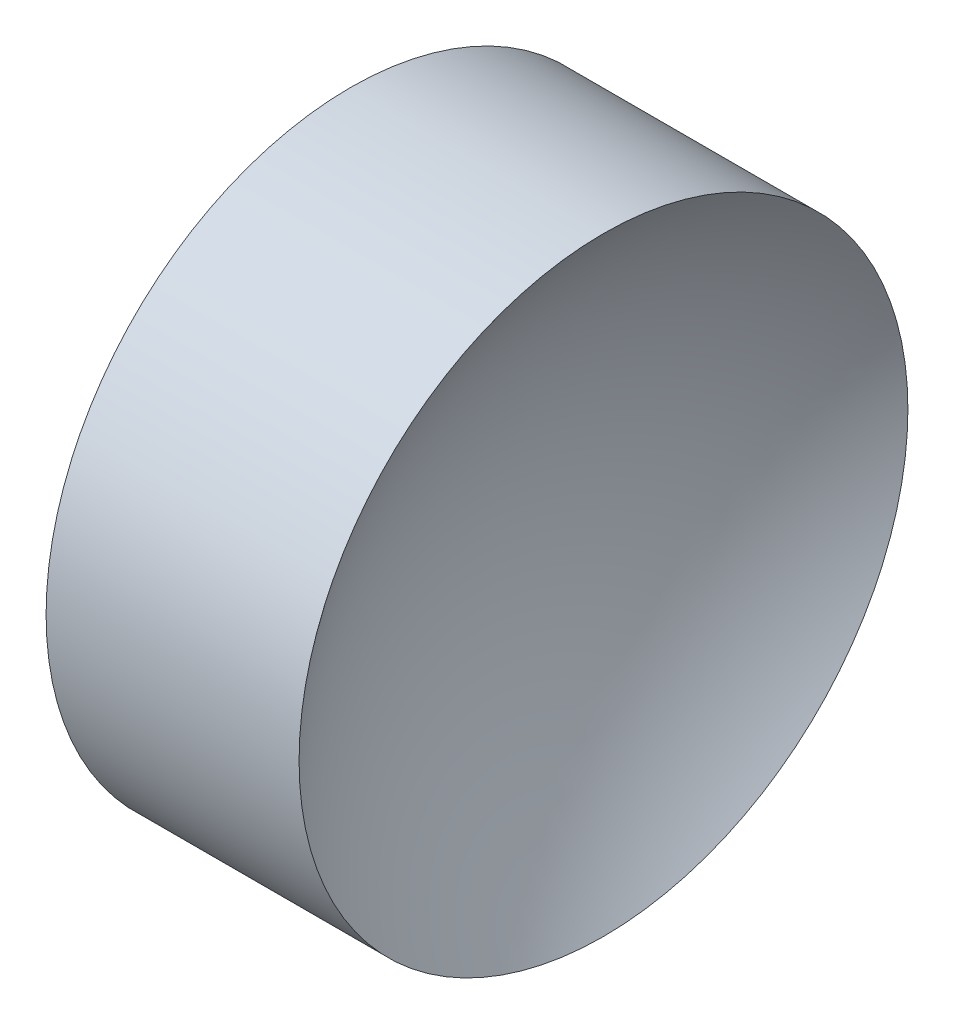
ISO-10303-21;
HEADER;
FILE_DESCRIPTION(('STEP AP214'),'2;1');
FILE_NAME('part.step','',(''),(''),'','','');
FILE_SCHEMA(('AUTOMOTIVE_DESIGN { 1 0 10303 214 1 1 1 1 }'));
ENDSEC;
DATA;
#1=APPLICATION_CONTEXT('core data for automotive mechanical design processes');
#2=APPLICATION_PROTOCOL_DEFINITION('international standard','automotive_design',2000,#1);
#3=PRODUCT_CONTEXT('',#1,'mechanical');
#4=PRODUCT('Part','Part','',(#3));
#5=PRODUCT_RELATED_PRODUCT_CATEGORY('part','',(#4));
#6=PRODUCT_DEFINITION_FORMATION('','',#4);
#7=PRODUCT_DEFINITION_CONTEXT('part definition',#1,'design');
#8=PRODUCT_DEFINITION('design','',#6,#7);
#9=PRODUCT_DEFINITION_SHAPE('','',#8);
#10=(LENGTH_UNIT() NAMED_UNIT(*) SI_UNIT(.MILLI.,.METRE.));
#11=(NAMED_UNIT(*) PLANE_ANGLE_UNIT() SI_UNIT($,.RADIAN.));
#12=(NAMED_UNIT(*) SI_UNIT($,.STERADIAN.) SOLID_ANGLE_UNIT());
#13=UNCERTAINTY_MEASURE_WITH_UNIT(LENGTH_MEASURE(1.E-05),#10,'distance_accuracy_value','');
#14=(GEOMETRIC_REPRESENTATION_CONTEXT(3) GLOBAL_UNCERTAINTY_ASSIGNED_CONTEXT((#13)) GLOBAL_UNIT_ASSIGNED_CONTEXT((#10,
#11,#12)) REPRESENTATION_CONTEXT('',''));
#15=CARTESIAN_POINT('',(0.,0.,0.));
#16=DIRECTION('',(0.,0.,1.));
#17=DIRECTION('',(1.,0.,0.));
#18=AXIS2_PLACEMENT_3D('',#15,#16,#17);
#19=CARTESIAN_POINT('',(379.562400985655,112.592117064009,0.));
#20=DIRECTION('',(-1.,0.,0.));
#21=DIRECTION('',(0.,-1.,0.));
#22=AXIS2_PLACEMENT_3D('',#19,#20,#21);
#23=SPHERICAL_SURFACE('',#22,10.);
#24=CARTESIAN_POINT('',(371.756153487657,112.592117064009,0.));
#25=DIRECTION('',(-1.,0.,0.));
#26=DIRECTION('',(0.,0.,1.));
#27=AXIS2_PLACEMENT_3D('',#24,#25,#26);
#28=CIRCLE('',#27,6.25000000000001);
#29=CARTESIAN_POINT('',(371.756153487657,112.592117064009,6.25000000000001));
#30=VERTEX_POINT('',#29);
#31=EDGE_CURVE('E10',#30,#30,#28,.T.);
#32=ORIENTED_EDGE('',*,*,#31,.F.);
#33=EDGE_LOOP('',(#32));
#34=FACE_BOUND('',#33,.T.);
#35=ADVANCED_FACE('F35',(#34),#23,.F.);
#36=CARTESIAN_POINT('',(363.508644719278,112.592117064009,0.));
#37=DIRECTION('',(-1.,0.,0.));
#38=DIRECTION('',(0.,0.,1.));
#39=AXIS2_PLACEMENT_3D('',#36,#37,#38);
#40=CYLINDRICAL_SURFACE('',#39,6.25000000000001);
#41=CARTESIAN_POINT('',(366.562400985655,112.592117064009,0.));
#42=DIRECTION('',(-1.,0.,0.));
#43=DIRECTION('',(0.,0.,1.));
#44=AXIS2_PLACEMENT_3D('',#41,#42,#43);
#45=CIRCLE('',#44,6.25000000000001);
#46=CARTESIAN_POINT('',(366.562400985655,112.592117064009,6.25000000000001));
#47=VERTEX_POINT('',#46);
#48=EDGE_CURVE('E41',#47,#47,#45,.T.);
#49=ORIENTED_EDGE('',*,*,#48,.F.);
#50=EDGE_LOOP('',(#49));
#51=FACE_BOUND('',#50,.T.);
#52=ORIENTED_EDGE('',*,*,#31,.T.);
#53=EDGE_LOOP('',(#52));
#54=FACE_BOUND('',#53,.T.);
#55=ADVANCED_FACE('F49',(#51,#54),#40,.T.);
#56=CARTESIAN_POINT('',(366.562400985655,112.592117064009,0.));
#57=DIRECTION('',(1.,0.,0.));
#58=DIRECTION('',(0.,0.,-1.));
#59=AXIS2_PLACEMENT_3D('',#56,#57,#58);
#60=PLANE('',#59);
#61=ORIENTED_EDGE('',*,*,#48,.T.);
#62=EDGE_LOOP('',(#61));
#63=FACE_BOUND('',#62,.T.);
#64=ADVANCED_FACE('F47',(#63),#60,.F.);
#65=CLOSED_SHELL('',(#35,#55,#64));
#66=MANIFOLD_SOLID_BREP('B2',#65);
#67=ADVANCED_BREP_SHAPE_REPRESENTATION('',(#18,#66),#14);
#68=SHAPE_DEFINITION_REPRESENTATION(#9,#67);
ENDSEC;
END-ISO-10303-21;
